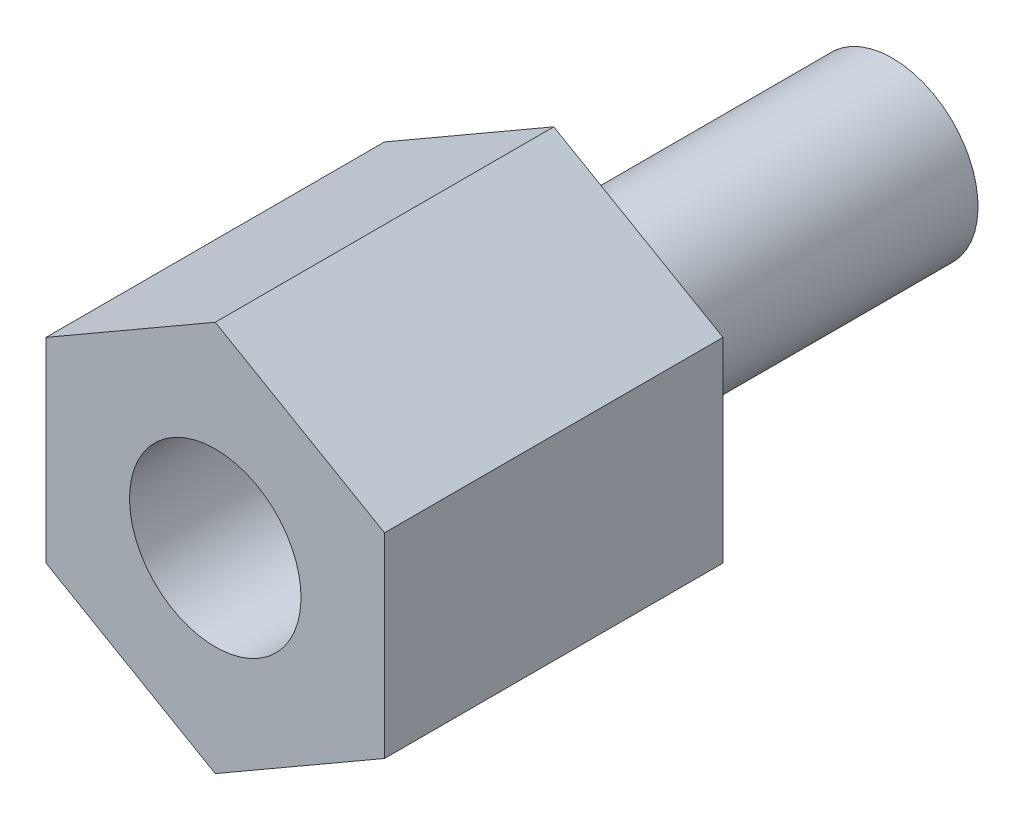
ISO-10303-21;
HEADER;
FILE_DESCRIPTION(('STEP AP214'),'2;1');
FILE_NAME('part.step','',(''),(''),'','','');
FILE_SCHEMA(('AUTOMOTIVE_DESIGN { 1 0 10303 214 1 1 1 1 }'));
ENDSEC;
DATA;
#1=APPLICATION_CONTEXT('core data for automotive mechanical design processes');
#2=APPLICATION_PROTOCOL_DEFINITION('international standard','automotive_design',2000,#1);
#3=PRODUCT_CONTEXT('',#1,'mechanical');
#4=PRODUCT('Part','Part','',(#3));
#5=PRODUCT_RELATED_PRODUCT_CATEGORY('part','',(#4));
#6=PRODUCT_DEFINITION_FORMATION('','',#4);
#7=PRODUCT_DEFINITION_CONTEXT('part definition',#1,'design');
#8=PRODUCT_DEFINITION('design','',#6,#7);
#9=PRODUCT_DEFINITION_SHAPE('','',#8);
#10=(LENGTH_UNIT() NAMED_UNIT(*) SI_UNIT(.MILLI.,.METRE.));
#11=(NAMED_UNIT(*) PLANE_ANGLE_UNIT() SI_UNIT($,.RADIAN.));
#12=(NAMED_UNIT(*) SI_UNIT($,.STERADIAN.) SOLID_ANGLE_UNIT());
#13=UNCERTAINTY_MEASURE_WITH_UNIT(LENGTH_MEASURE(1.E-05),#10,'distance_accuracy_value','');
#14=(GEOMETRIC_REPRESENTATION_CONTEXT(3) GLOBAL_UNCERTAINTY_ASSIGNED_CONTEXT((#13)) GLOBAL_UNIT_ASSIGNED_CONTEXT((#10,
#11,#12)) REPRESENTATION_CONTEXT('',''));
#15=CARTESIAN_POINT('',(0.,0.,0.));
#16=DIRECTION('',(0.,0.,1.));
#17=DIRECTION('',(1.,0.,0.));
#18=AXIS2_PLACEMENT_3D('',#15,#16,#17);
#19=CARTESIAN_POINT('',(0.,1.89744425180957,0.));
#20=DIRECTION('',(0.,0.,-1.));
#21=DIRECTION('',(0.,1.,0.));
#22=AXIS2_PLACEMENT_3D('',#19,#20,#21);
#23=PLANE('',#22);
#24=DIRECTION('',(-0.866025403784439,-0.5,0.));
#25=VECTOR('',#24,1.);
#26=CARTESIAN_POINT('',(0.,5.49926131403118,0.));
#27=LINE('',#26,#25);
#28=CARTESIAN_POINT('',(0.,5.49926131403118,0.));
#29=VERTEX_POINT('',#28);
#30=CARTESIAN_POINT('',(-4.7625,2.74963065701559,0.));
#31=VERTEX_POINT('',#30);
#32=EDGE_CURVE('E56',#29,#31,#27,.T.);
#33=ORIENTED_EDGE('',*,*,#32,.F.);
#34=DIRECTION('',(-0.866025403784439,0.5,0.));
#35=VECTOR('',#34,1.);
#36=CARTESIAN_POINT('',(4.7625,2.74963065701559,0.));
#37=LINE('',#36,#35);
#38=CARTESIAN_POINT('',(4.7625,2.74963065701559,0.));
#39=VERTEX_POINT('',#38);
#40=EDGE_CURVE('E112',#39,#29,#37,.T.);
#41=ORIENTED_EDGE('',*,*,#40,.F.);
#42=DIRECTION('',(0.,1.,0.));
#43=VECTOR('',#42,1.);
#44=CARTESIAN_POINT('',(4.7625,-2.74963065701559,0.));
#45=LINE('',#44,#43);
#46=CARTESIAN_POINT('',(4.7625,-2.7496306570156,0.));
#47=VERTEX_POINT('',#46);
#48=EDGE_CURVE('E110',#47,#39,#45,.T.);
#49=ORIENTED_EDGE('',*,*,#48,.F.);
#50=DIRECTION('',(0.866025403784439,0.5,0.));
#51=VECTOR('',#50,1.);
#52=CARTESIAN_POINT('',(0.,-5.49926131403119,0.));
#53=LINE('',#52,#51);
#54=CARTESIAN_POINT('',(0.,-5.49926131403119,0.));
#55=VERTEX_POINT('',#54);
#56=EDGE_CURVE('E98',#55,#47,#53,.T.);
#57=ORIENTED_EDGE('',*,*,#56,.F.);
#58=DIRECTION('',(0.866025403784439,-0.5,0.));
#59=VECTOR('',#58,1.);
#60=CARTESIAN_POINT('',(-4.7625,-2.7496306570156,0.));
#61=LINE('',#60,#59);
#62=CARTESIAN_POINT('',(-4.7625,-2.7496306570156,0.));
#63=VERTEX_POINT('',#62);
#64=EDGE_CURVE('E121',#63,#55,#61,.T.);
#65=ORIENTED_EDGE('',*,*,#64,.F.);
#66=DIRECTION('',(0.,-1.,0.));
#67=VECTOR('',#66,1.);
#68=CARTESIAN_POINT('',(-4.7625,2.74963065701559,0.));
#69=LINE('',#68,#67);
#70=EDGE_CURVE('E64',#31,#63,#69,.T.);
#71=ORIENTED_EDGE('',*,*,#70,.F.);
#72=EDGE_LOOP('',(#33,#41,#49,#57,#65,#71));
#73=FACE_BOUND('',#72,.T.);
#74=CARTESIAN_POINT('',(0.,0.,0.));
#75=DIRECTION('',(0.,0.,-1.));
#76=DIRECTION('',(0.,1.,0.));
#77=AXIS2_PLACEMENT_3D('',#74,#75,#76);
#78=CIRCLE('',#77,1.89744425180957);
#79=CARTESIAN_POINT('',(0.,1.89744425180957,0.));
#80=VERTEX_POINT('',#79);
#81=EDGE_CURVE('E11',#80,#80,#78,.T.);
#82=ORIENTED_EDGE('',*,*,#81,.F.);
#83=EDGE_LOOP('',(#82));
#84=FACE_BOUND('',#83,.T.);
#85=ADVANCED_FACE('F41',(#73,#84),#23,.T.);
#86=CARTESIAN_POINT('',(0.,0.,-9.525));
#87=DIRECTION('',(0.,0.,-1.));
#88=DIRECTION('',(0.,1.,0.));
#89=AXIS2_PLACEMENT_3D('',#86,#87,#88);
#90=CYLINDRICAL_SURFACE('',#89,1.89744425180957);
#91=ORIENTED_EDGE('',*,*,#81,.T.);
#92=EDGE_LOOP('',(#91));
#93=FACE_BOUND('',#92,.T.);
#94=CARTESIAN_POINT('',(0.,0.,-1.143));
#95=DIRECTION('',(0.,0.,-1.));
#96=DIRECTION('',(0.,1.,0.));
#97=AXIS2_PLACEMENT_3D('',#94,#95,#96);
#98=CIRCLE('',#97,1.89744425180957);
#99=CARTESIAN_POINT('',(0.,1.89744425180957,-1.143));
#100=VERTEX_POINT('',#99);
#101=EDGE_CURVE('E49',#100,#100,#98,.T.);
#102=ORIENTED_EDGE('',*,*,#101,.F.);
#103=EDGE_LOOP('',(#102));
#104=FACE_BOUND('',#103,.T.);
#105=ADVANCED_FACE('F151',(#93,#104),#90,.T.);
#106=CARTESIAN_POINT('',(0.,0.,-1.44065625));
#107=DIRECTION('',(0.,0.,-1.));
#108=DIRECTION('',(0.,1.,0.));
#109=AXIS2_PLACEMENT_3D('',#106,#107,#108);
#110=CONICAL_SURFACE('',#109,2.413,1.0471975511966);
#111=ORIENTED_EDGE('',*,*,#101,.T.);
#112=EDGE_LOOP('',(#111));
#113=FACE_BOUND('',#112,.T.);
#114=CARTESIAN_POINT('',(0.,0.,-1.44065625));
#115=DIRECTION('',(0.,0.,-1.));
#116=DIRECTION('',(0.,1.,0.));
#117=AXIS2_PLACEMENT_3D('',#114,#115,#116);
#118=CIRCLE('',#117,2.413);
#119=CARTESIAN_POINT('',(0.,2.413,-1.44065625));
#120=VERTEX_POINT('',#119);
#121=EDGE_CURVE('E143',#120,#120,#118,.T.);
#122=ORIENTED_EDGE('',*,*,#121,.F.);
#123=EDGE_LOOP('',(#122));
#124=FACE_BOUND('',#123,.T.);
#125=ADVANCED_FACE('F148',(#113,#124),#110,.T.);
#126=CARTESIAN_POINT('',(0.,0.,-9.525));
#127=DIRECTION('',(0.,0.,-1.));
#128=DIRECTION('',(0.,1.,0.));
#129=AXIS2_PLACEMENT_3D('',#126,#127,#128);
#130=CYLINDRICAL_SURFACE('',#129,2.413);
#131=ORIENTED_EDGE('',*,*,#121,.T.);
#132=EDGE_LOOP('',(#131));
#133=FACE_BOUND('',#132,.T.);
#134=CARTESIAN_POINT('',(0.,0.,-9.525));
#135=DIRECTION('',(0.,0.,-1.));
#136=DIRECTION('',(0.,1.,0.));
#137=AXIS2_PLACEMENT_3D('',#134,#135,#136);
#138=CIRCLE('',#137,2.413);
#139=CARTESIAN_POINT('',(0.,2.413,-9.525));
#140=VERTEX_POINT('',#139);
#141=EDGE_CURVE('E140',#140,#140,#138,.T.);
#142=ORIENTED_EDGE('',*,*,#141,.F.);
#143=EDGE_LOOP('',(#142));
#144=FACE_BOUND('',#143,.T.);
#145=ADVANCED_FACE('F159',(#133,#144),#130,.T.);
#146=CARTESIAN_POINT('',(0.,0.,-9.525));
#147=DIRECTION('',(0.,0.,-1.));
#148=DIRECTION('',(0.,1.,0.));
#149=AXIS2_PLACEMENT_3D('',#146,#147,#148);
#150=PLANE('',#149);
#151=ORIENTED_EDGE('',*,*,#141,.T.);
#152=EDGE_LOOP('',(#151));
#153=FACE_BOUND('',#152,.T.);
#154=ADVANCED_FACE('F164',(#153),#150,.T.);
#155=CARTESIAN_POINT('',(0.,5.49926131403118,-14.5496778314848));
#156=DIRECTION('',(-0.5,0.866025403784438,0.));
#157=DIRECTION('',(-0.866025403784439,-0.5,0.));
#158=AXIS2_PLACEMENT_3D('',#155,#156,#157);
#159=PLANE('',#158);
#160=ORIENTED_EDGE('',*,*,#32,.T.);
#161=DIRECTION('',(0.,0.,1.));
#162=VECTOR('',#161,1.);
#163=CARTESIAN_POINT('',(-4.7625,2.74963065701559,-14.5496778314848));
#164=LINE('',#163,#162);
#165=CARTESIAN_POINT('',(-4.7625,2.74963065701559,9.525));
#166=VERTEX_POINT('',#165);
#167=EDGE_CURVE('E131',#31,#166,#164,.T.);
#168=ORIENTED_EDGE('',*,*,#167,.T.);
#169=DIRECTION('',(-0.866025403784438,-0.5,0.));
#170=VECTOR('',#169,1.);
#171=CARTESIAN_POINT('',(0.,5.49926131403118,9.525));
#172=LINE('',#171,#170);
#173=CARTESIAN_POINT('',(0.,5.49926131403118,9.525));
#174=VERTEX_POINT('',#173);
#175=EDGE_CURVE('E130',#174,#166,#172,.T.);
#176=ORIENTED_EDGE('',*,*,#175,.F.);
#177=DIRECTION('',(0.,0.,1.));
#178=VECTOR('',#177,1.);
#179=CARTESIAN_POINT('',(0.,5.49926131403118,-14.5496778314848));
#180=LINE('',#179,#178);
#181=EDGE_CURVE('E116',#29,#174,#180,.T.);
#182=ORIENTED_EDGE('',*,*,#181,.F.);
#183=EDGE_LOOP('',(#160,#168,#176,#182));
#184=FACE_BOUND('',#183,.T.);
#185=ADVANCED_FACE('F168',(#184),#159,.T.);
#186=CARTESIAN_POINT('',(4.7625,2.74963065701559,-14.5496778314848));
#187=DIRECTION('',(0.5,0.866025403784438,0.));
#188=DIRECTION('',(-0.866025403784439,0.5,0.));
#189=AXIS2_PLACEMENT_3D('',#186,#187,#188);
#190=PLANE('',#189);
#191=ORIENTED_EDGE('',*,*,#40,.T.);
#192=ORIENTED_EDGE('',*,*,#181,.T.);
#193=DIRECTION('',(-0.866025403784439,0.5,0.));
#194=VECTOR('',#193,1.);
#195=CARTESIAN_POINT('',(4.7625,2.74963065701559,9.525));
#196=LINE('',#195,#194);
#197=CARTESIAN_POINT('',(4.7625,2.74963065701559,9.525));
#198=VERTEX_POINT('',#197);
#199=EDGE_CURVE('E137',#198,#174,#196,.T.);
#200=ORIENTED_EDGE('',*,*,#199,.F.);
#201=DIRECTION('',(0.,0.,1.));
#202=VECTOR('',#201,1.);
#203=CARTESIAN_POINT('',(4.7625,2.74963065701559,-14.5496778314848));
#204=LINE('',#203,#202);
#205=EDGE_CURVE('E107',#39,#198,#204,.T.);
#206=ORIENTED_EDGE('',*,*,#205,.F.);
#207=EDGE_LOOP('',(#191,#192,#200,#206));
#208=FACE_BOUND('',#207,.T.);
#209=ADVANCED_FACE('F181',(#208),#190,.T.);
#210=CARTESIAN_POINT('',(4.7625,-2.7496306570156,-14.5496778314848));
#211=DIRECTION('',(1.,0.,0.));
#212=DIRECTION('',(0.,0.,-1.));
#213=AXIS2_PLACEMENT_3D('',#210,#211,#212);
#214=PLANE('',#213);
#215=ORIENTED_EDGE('',*,*,#48,.T.);
#216=ORIENTED_EDGE('',*,*,#205,.T.);
#217=DIRECTION('',(0.,1.,0.));
#218=VECTOR('',#217,1.);
#219=CARTESIAN_POINT('',(4.7625,-2.7496306570156,9.525));
#220=LINE('',#219,#218);
#221=CARTESIAN_POINT('',(4.7625,-2.7496306570156,9.525));
#222=VERTEX_POINT('',#221);
#223=EDGE_CURVE('E119',#222,#198,#220,.T.);
#224=ORIENTED_EDGE('',*,*,#223,.F.);
#225=DIRECTION('',(0.,0.,1.));
#226=VECTOR('',#225,1.);
#227=CARTESIAN_POINT('',(4.7625,-2.7496306570156,-14.5496778314848));
#228=LINE('',#227,#226);
#229=EDGE_CURVE('E103',#47,#222,#228,.T.);
#230=ORIENTED_EDGE('',*,*,#229,.F.);
#231=EDGE_LOOP('',(#215,#216,#224,#230));
#232=FACE_BOUND('',#231,.T.);
#233=ADVANCED_FACE('F118',(#232),#214,.T.);
#234=CARTESIAN_POINT('',(0.,-5.49926131403119,-14.5496778314848));
#235=DIRECTION('',(0.5,-0.866025403784439,0.));
#236=DIRECTION('',(0.866025403784439,0.5,0.));
#237=AXIS2_PLACEMENT_3D('',#234,#235,#236);
#238=PLANE('',#237);
#239=ORIENTED_EDGE('',*,*,#56,.T.);
#240=ORIENTED_EDGE('',*,*,#229,.T.);
#241=DIRECTION('',(0.866025403784439,0.5,0.));
#242=VECTOR('',#241,1.);
#243=CARTESIAN_POINT('',(0.,-5.49926131403119,9.525));
#244=LINE('',#243,#242);
#245=CARTESIAN_POINT('',(0.,-5.49926131403119,9.525));
#246=VERTEX_POINT('',#245);
#247=EDGE_CURVE('E313',#246,#222,#244,.T.);
#248=ORIENTED_EDGE('',*,*,#247,.F.);
#249=DIRECTION('',(0.,0.,1.));
#250=VECTOR('',#249,1.);
#251=CARTESIAN_POINT('',(0.,-5.49926131403119,-14.5496778314848));
#252=LINE('',#251,#250);
#253=EDGE_CURVE('E105',#55,#246,#252,.T.);
#254=ORIENTED_EDGE('',*,*,#253,.F.);
#255=EDGE_LOOP('',(#239,#240,#248,#254));
#256=FACE_BOUND('',#255,.T.);
#257=ADVANCED_FACE('F100',(#256),#238,.T.);
#258=CARTESIAN_POINT('',(-4.7625,-2.7496306570156,-14.5496778314848));
#259=DIRECTION('',(-0.5,-0.866025403784439,0.));
#260=DIRECTION('',(0.866025403784439,-0.5,0.));
#261=AXIS2_PLACEMENT_3D('',#258,#259,#260);
#262=PLANE('',#261);
#263=ORIENTED_EDGE('',*,*,#64,.T.);
#264=ORIENTED_EDGE('',*,*,#253,.T.);
#265=DIRECTION('',(0.866025403784439,-0.5,0.));
#266=VECTOR('',#265,1.);
#267=CARTESIAN_POINT('',(-4.7625,-2.7496306570156,9.525));
#268=LINE('',#267,#266);
#269=CARTESIAN_POINT('',(-4.7625,-2.7496306570156,9.525));
#270=VERTEX_POINT('',#269);
#271=EDGE_CURVE('E318',#270,#246,#268,.T.);
#272=ORIENTED_EDGE('',*,*,#271,.F.);
#273=DIRECTION('',(0.,0.,1.));
#274=VECTOR('',#273,1.);
#275=CARTESIAN_POINT('',(-4.7625,-2.7496306570156,-14.5496778314848));
#276=LINE('',#275,#274);
#277=EDGE_CURVE('E128',#63,#270,#276,.T.);
#278=ORIENTED_EDGE('',*,*,#277,.F.);
#279=EDGE_LOOP('',(#263,#264,#272,#278));
#280=FACE_BOUND('',#279,.T.);
#281=ADVANCED_FACE('F189',(#280),#262,.T.);
#282=CARTESIAN_POINT('',(-4.7625,2.74963065701559,-14.5496778314848));
#283=DIRECTION('',(-1.,0.,0.));
#284=DIRECTION('',(0.,0.,1.));
#285=AXIS2_PLACEMENT_3D('',#282,#283,#284);
#286=PLANE('',#285);
#287=ORIENTED_EDGE('',*,*,#70,.T.);
#288=ORIENTED_EDGE('',*,*,#277,.T.);
#289=DIRECTION('',(0.,-1.,0.));
#290=VECTOR('',#289,1.);
#291=CARTESIAN_POINT('',(-4.7625,2.74963065701559,9.525));
#292=LINE('',#291,#290);
#293=EDGE_CURVE('E321',#166,#270,#292,.T.);
#294=ORIENTED_EDGE('',*,*,#293,.F.);
#295=ORIENTED_EDGE('',*,*,#167,.F.);
#296=EDGE_LOOP('',(#287,#288,#294,#295));
#297=FACE_BOUND('',#296,.T.);
#298=ADVANCED_FACE('F174',(#297),#286,.T.);
#299=CARTESIAN_POINT('',(0.,0.,4.7498));
#300=DIRECTION('',(0.,0.,-1.));
#301=DIRECTION('',(0.,1.,0.));
#302=AXIS2_PLACEMENT_3D('',#299,#300,#301);
#303=PLANE('',#302);
#304=CARTESIAN_POINT('',(0.,0.,4.7498));
#305=DIRECTION('',(0.,0.,-1.));
#306=DIRECTION('',(0.,1.,0.));
#307=AXIS2_PLACEMENT_3D('',#304,#305,#306);
#308=CIRCLE('',#307,2.413);
#309=CARTESIAN_POINT('',(0.,2.41299999999999,4.7498));
#310=VERTEX_POINT('',#309);
#311=EDGE_CURVE('E136',#310,#310,#308,.T.);
#312=ORIENTED_EDGE('',*,*,#311,.F.);
#313=EDGE_LOOP('',(#312));
#314=FACE_BOUND('',#313,.T.);
#315=ADVANCED_FACE('F170',(#314),#303,.F.);
#316=CARTESIAN_POINT('',(0.,0.,-9.525));
#317=DIRECTION('',(0.,0.,-1.));
#318=DIRECTION('',(0.,1.,0.));
#319=AXIS2_PLACEMENT_3D('',#316,#317,#318);
#320=CYLINDRICAL_SURFACE('',#319,2.413);
#321=CARTESIAN_POINT('',(0.,0.,9.525));
#322=DIRECTION('',(0.,0.,-1.));
#323=DIRECTION('',(0.,1.,0.));
#324=AXIS2_PLACEMENT_3D('',#321,#322,#323);
#325=CIRCLE('',#324,2.413);
#326=CARTESIAN_POINT('',(0.,2.413,9.525));
#327=VERTEX_POINT('',#326);
#328=EDGE_CURVE('E133',#327,#327,#325,.T.);
#329=ORIENTED_EDGE('',*,*,#328,.F.);
#330=EDGE_LOOP('',(#329));
#331=FACE_BOUND('',#330,.T.);
#332=ORIENTED_EDGE('',*,*,#311,.T.);
#333=EDGE_LOOP('',(#332));
#334=FACE_BOUND('',#333,.T.);
#335=ADVANCED_FACE('F173',(#331,#334),#320,.F.);
#336=CARTESIAN_POINT('',(0.,2.413,9.525));
#337=DIRECTION('',(0.,0.,-1.));
#338=DIRECTION('',(0.,1.,0.));
#339=AXIS2_PLACEMENT_3D('',#336,#337,#338);
#340=PLANE('',#339);
#341=ORIENTED_EDGE('',*,*,#247,.T.);
#342=ORIENTED_EDGE('',*,*,#223,.T.);
#343=ORIENTED_EDGE('',*,*,#199,.T.);
#344=ORIENTED_EDGE('',*,*,#175,.T.);
#345=ORIENTED_EDGE('',*,*,#293,.T.);
#346=ORIENTED_EDGE('',*,*,#271,.T.);
#347=EDGE_LOOP('',(#341,#342,#343,#344,#345,#346));
#348=FACE_BOUND('',#347,.T.);
#349=ORIENTED_EDGE('',*,*,#328,.T.);
#350=EDGE_LOOP('',(#349));
#351=FACE_BOUND('',#350,.T.);
#352=ADVANCED_FACE('F43',(#348,#351),#340,.F.);
#353=CLOSED_SHELL('',(#85,#105,#125,#145,#154,#185,#209,#233,#257,#281,#298,#315,#335,#352));
#354=MANIFOLD_SOLID_BREP('B2',#353);
#355=ADVANCED_BREP_SHAPE_REPRESENTATION('',(#18,#354),#14);
#356=SHAPE_DEFINITION_REPRESENTATION(#9,#355);
ENDSEC;
END-ISO-10303-21;
